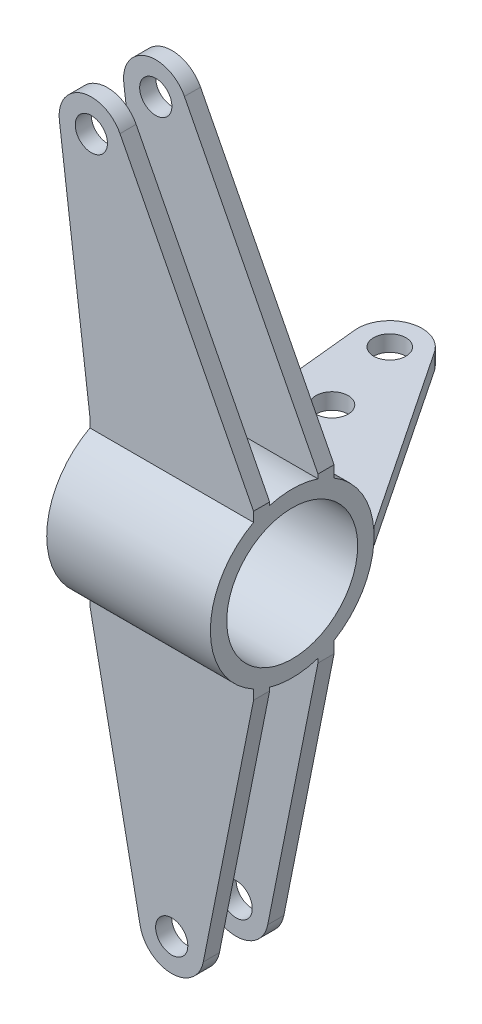
ISO-10303-21;
HEADER;
FILE_DESCRIPTION(('STEP AP214'),'2;1');
FILE_NAME('part.step','',(''),(''),'','','');
FILE_SCHEMA(('AUTOMOTIVE_DESIGN { 1 0 10303 214 1 1 1 1 }'));
ENDSEC;
DATA;
#1=APPLICATION_CONTEXT('core data for automotive mechanical design processes');
#2=APPLICATION_PROTOCOL_DEFINITION('international standard','automotive_design',2000,#1);
#3=PRODUCT_CONTEXT('',#1,'mechanical');
#4=PRODUCT('Part','Part','',(#3));
#5=PRODUCT_RELATED_PRODUCT_CATEGORY('part','',(#4));
#6=PRODUCT_DEFINITION_FORMATION('','',#4);
#7=PRODUCT_DEFINITION_CONTEXT('part definition',#1,'design');
#8=PRODUCT_DEFINITION('design','',#6,#7);
#9=PRODUCT_DEFINITION_SHAPE('','',#8);
#10=(LENGTH_UNIT() NAMED_UNIT(*) SI_UNIT(.MILLI.,.METRE.));
#11=(NAMED_UNIT(*) PLANE_ANGLE_UNIT() SI_UNIT($,.RADIAN.));
#12=(NAMED_UNIT(*) SI_UNIT($,.STERADIAN.) SOLID_ANGLE_UNIT());
#13=UNCERTAINTY_MEASURE_WITH_UNIT(LENGTH_MEASURE(1.E-05),#10,'distance_accuracy_value','');
#14=(GEOMETRIC_REPRESENTATION_CONTEXT(3) GLOBAL_UNCERTAINTY_ASSIGNED_CONTEXT((#13)) GLOBAL_UNIT_ASSIGNED_CONTEXT((#10,
#11,#12)) REPRESENTATION_CONTEXT('',''));
#15=CARTESIAN_POINT('',(0.,0.,0.));
#16=DIRECTION('',(0.,0.,1.));
#17=DIRECTION('',(1.,0.,0.));
#18=AXIS2_PLACEMENT_3D('',#15,#16,#17);
#19=CARTESIAN_POINT('',(-20.5175410322136,2.5,-76.2));
#20=DIRECTION('',(0.,1.,0.));
#21=DIRECTION('',(0.,0.,1.));
#22=AXIS2_PLACEMENT_3D('',#19,#20,#21);
#23=PLANE('',#22);
#24=CARTESIAN_POINT('',(-20.5175410322136,2.5,-76.2));
#25=DIRECTION('',(0.,1.,0.));
#26=DIRECTION('',(0.,0.,1.));
#27=AXIS2_PLACEMENT_3D('',#24,#25,#26);
#28=CIRCLE('',#27,5.);
#29=CARTESIAN_POINT('',(-20.5175410322136,2.5,-71.2));
#30=VERTEX_POINT('',#29);
#31=EDGE_CURVE('E116',#30,#30,#28,.T.);
#32=ORIENTED_EDGE('',*,*,#31,.F.);
#33=EDGE_LOOP('',(#32));
#34=FACE_BOUND('',#33,.T.);
#35=DIRECTION('',(1.,0.,0.));
#36=VECTOR('',#35,1.);
#37=CARTESIAN_POINT('',(-25.4,2.5,-25.4));
#38=LINE('',#37,#36);
#39=CARTESIAN_POINT('',(-25.4,2.5,-25.4));
#40=VERTEX_POINT('',#39);
#41=CARTESIAN_POINT('',(25.4,2.5,-25.4));
#42=VERTEX_POINT('',#41);
#43=EDGE_CURVE('E101',#40,#42,#38,.T.);
#44=ORIENTED_EDGE('',*,*,#43,.T.);
#45=DIRECTION('',(-0.555030974268581,0.,-0.831829680645305));
#46=VECTOR('',#45,1.);
#47=CARTESIAN_POINT('',(25.4,2.5,-25.4));
#48=LINE('',#47,#46);
#49=CARTESIAN_POINT('',(-12.1992442257605,2.5,-81.7503097426858));
#50=VERTEX_POINT('',#49);
#51=EDGE_CURVE('E96',#42,#50,#48,.T.);
#52=ORIENTED_EDGE('',*,*,#51,.T.);
#53=CARTESIAN_POINT('',(-20.5175410322136,2.5,-76.2));
#54=DIRECTION('',(0.,1.,0.));
#55=DIRECTION('',(0.,0.,1.));
#56=AXIS2_PLACEMENT_3D('',#53,#54,#55);
#57=CIRCLE('',#56,10.);
#58=CARTESIAN_POINT('',(-30.4661687352724,2.5,-75.1876725698025));
#59=VERTEX_POINT('',#58);
#60=EDGE_CURVE('E99',#50,#59,#57,.T.);
#61=ORIENTED_EDGE('',*,*,#60,.T.);
#62=DIRECTION('',(0.101232743019748,0.,0.994862770305884));
#63=VECTOR('',#62,1.);
#64=CARTESIAN_POINT('',(-25.4,2.5,-25.4));
#65=LINE('',#64,#63);
#66=EDGE_CURVE('E66',#59,#40,#65,.T.);
#67=ORIENTED_EDGE('',*,*,#66,.T.);
#68=EDGE_LOOP('',(#44,#52,#61,#67));
#69=FACE_BOUND('',#68,.T.);
#70=CARTESIAN_POINT('',(-13.9135676344222,2.5,-51.6735339814056));
#71=DIRECTION('',(0.,1.,0.));
#72=DIRECTION('',(0.,0.,1.));
#73=AXIS2_PLACEMENT_3D('',#70,#71,#72);
#74=CIRCLE('',#73,5.);
#75=CARTESIAN_POINT('',(-13.9135676344222,2.5,-46.6735339814056));
#76=VERTEX_POINT('',#75);
#77=EDGE_CURVE('E131',#76,#76,#74,.T.);
#78=ORIENTED_EDGE('',*,*,#77,.F.);
#79=EDGE_LOOP('',(#78));
#80=FACE_BOUND('',#79,.T.);
#81=ADVANCED_FACE('F49',(#34,#69,#80),#23,.T.);
#82=CARTESIAN_POINT('',(-20.5175410322136,-2.5,-76.2));
#83=DIRECTION('',(0.,1.,0.));
#84=DIRECTION('',(0.,0.,1.));
#85=AXIS2_PLACEMENT_3D('',#82,#83,#84);
#86=PLANE('',#85);
#87=DIRECTION('',(1.,0.,0.));
#88=VECTOR('',#87,1.);
#89=CARTESIAN_POINT('',(-25.4,-2.5,-25.4));
#90=LINE('',#89,#88);
#91=CARTESIAN_POINT('',(-25.4,-2.5,-25.4));
#92=VERTEX_POINT('',#91);
#93=CARTESIAN_POINT('',(25.4,-2.5,-25.4));
#94=VERTEX_POINT('',#93);
#95=EDGE_CURVE('E113',#92,#94,#90,.T.);
#96=ORIENTED_EDGE('',*,*,#95,.F.);
#97=DIRECTION('',(0.101232743019748,0.,0.994862770305884));
#98=VECTOR('',#97,1.);
#99=CARTESIAN_POINT('',(-25.4,-2.5,-25.4));
#100=LINE('',#99,#98);
#101=CARTESIAN_POINT('',(-30.4661687352724,-2.5,-75.1876725698025));
#102=VERTEX_POINT('',#101);
#103=EDGE_CURVE('E89',#102,#92,#100,.T.);
#104=ORIENTED_EDGE('',*,*,#103,.F.);
#105=CARTESIAN_POINT('',(-20.5175410322136,-2.5,-76.2));
#106=DIRECTION('',(0.,1.,0.));
#107=DIRECTION('',(0.,0.,1.));
#108=AXIS2_PLACEMENT_3D('',#105,#106,#107);
#109=CIRCLE('',#108,10.);
#110=CARTESIAN_POINT('',(-12.1992442257605,-2.5,-81.7503097426858));
#111=VERTEX_POINT('',#110);
#112=EDGE_CURVE('E83',#111,#102,#109,.T.);
#113=ORIENTED_EDGE('',*,*,#112,.F.);
#114=DIRECTION('',(-0.555030974268581,0.,-0.831829680645305));
#115=VECTOR('',#114,1.);
#116=CARTESIAN_POINT('',(25.4,-2.5,-25.4));
#117=LINE('',#116,#115);
#118=EDGE_CURVE('E105',#94,#111,#117,.T.);
#119=ORIENTED_EDGE('',*,*,#118,.F.);
#120=EDGE_LOOP('',(#96,#104,#113,#119));
#121=FACE_BOUND('',#120,.T.);
#122=CARTESIAN_POINT('',(-20.5175410322136,-2.5,-76.2));
#123=DIRECTION('',(0.,1.,0.));
#124=DIRECTION('',(0.,0.,1.));
#125=AXIS2_PLACEMENT_3D('',#122,#123,#124);
#126=CIRCLE('',#125,5.);
#127=CARTESIAN_POINT('',(-20.5175410322136,-2.5,-71.2));
#128=VERTEX_POINT('',#127);
#129=EDGE_CURVE('E128',#128,#128,#126,.T.);
#130=ORIENTED_EDGE('',*,*,#129,.T.);
#131=EDGE_LOOP('',(#130));
#132=FACE_BOUND('',#131,.T.);
#133=CARTESIAN_POINT('',(-13.9135676344222,-2.5,-51.6735339814056));
#134=DIRECTION('',(0.,1.,0.));
#135=DIRECTION('',(0.,0.,1.));
#136=AXIS2_PLACEMENT_3D('',#133,#134,#135);
#137=CIRCLE('',#136,5.);
#138=CARTESIAN_POINT('',(-13.9135676344222,-2.5,-46.6735339814056));
#139=VERTEX_POINT('',#138);
#140=EDGE_CURVE('E134',#139,#139,#137,.T.);
#141=ORIENTED_EDGE('',*,*,#140,.T.);
#142=EDGE_LOOP('',(#141));
#143=FACE_BOUND('',#142,.T.);
#144=ADVANCED_FACE('F124',(#121,#132,#143),#86,.F.);
#145=CARTESIAN_POINT('',(-25.4,2.5,-25.4));
#146=DIRECTION('',(0.,0.,-1.));
#147=DIRECTION('',(-1.,0.,0.));
#148=AXIS2_PLACEMENT_3D('',#145,#146,#147);
#149=PLANE('',#148);
#150=ORIENTED_EDGE('',*,*,#95,.T.);
#151=DIRECTION('',(0.,-1.,0.));
#152=VECTOR('',#151,1.);
#153=CARTESIAN_POINT('',(25.4,2.5,-25.4));
#154=LINE('',#153,#152);
#155=EDGE_CURVE('E12',#42,#94,#154,.T.);
#156=ORIENTED_EDGE('',*,*,#155,.F.);
#157=ORIENTED_EDGE('',*,*,#43,.F.);
#158=DIRECTION('',(0.,-1.,0.));
#159=VECTOR('',#158,1.);
#160=CARTESIAN_POINT('',(-25.4,2.5,-25.4));
#161=LINE('',#160,#159);
#162=EDGE_CURVE('E109',#40,#92,#161,.T.);
#163=ORIENTED_EDGE('',*,*,#162,.T.);
#164=EDGE_LOOP('',(#150,#156,#157,#163));
#165=FACE_BOUND('',#164,.T.);
#166=ADVANCED_FACE('F51',(#165),#149,.F.);
#167=CARTESIAN_POINT('',(25.4,2.5,-25.4));
#168=DIRECTION('',(-0.831829680645305,0.,0.555030974268581));
#169=DIRECTION('',(0.555030974268581,0.,0.831829680645305));
#170=AXIS2_PLACEMENT_3D('',#167,#168,#169);
#171=PLANE('',#170);
#172=ORIENTED_EDGE('',*,*,#118,.T.);
#173=DIRECTION('',(0.,-1.,0.));
#174=VECTOR('',#173,1.);
#175=CARTESIAN_POINT('',(-12.1992442257605,2.5,-81.7503097426858));
#176=LINE('',#175,#174);
#177=EDGE_CURVE('E58',#50,#111,#176,.T.);
#178=ORIENTED_EDGE('',*,*,#177,.F.);
#179=ORIENTED_EDGE('',*,*,#51,.F.);
#180=ORIENTED_EDGE('',*,*,#155,.T.);
#181=EDGE_LOOP('',(#172,#178,#179,#180));
#182=FACE_BOUND('',#181,.T.);
#183=ADVANCED_FACE('F104',(#182),#171,.F.);
#184=CARTESIAN_POINT('',(-20.5175410322136,2.5,-76.2));
#185=DIRECTION('',(0.,-1.,0.));
#186=DIRECTION('',(0.,0.,-1.));
#187=AXIS2_PLACEMENT_3D('',#184,#185,#186);
#188=CYLINDRICAL_SURFACE('',#187,10.);
#189=ORIENTED_EDGE('',*,*,#112,.T.);
#190=DIRECTION('',(0.,-1.,0.));
#191=VECTOR('',#190,1.);
#192=CARTESIAN_POINT('',(-30.4661687352724,2.5,-75.1876725698025));
#193=LINE('',#192,#191);
#194=EDGE_CURVE('E106',#59,#102,#193,.T.);
#195=ORIENTED_EDGE('',*,*,#194,.F.);
#196=ORIENTED_EDGE('',*,*,#60,.F.);
#197=ORIENTED_EDGE('',*,*,#177,.T.);
#198=EDGE_LOOP('',(#189,#195,#196,#197));
#199=FACE_BOUND('',#198,.T.);
#200=ADVANCED_FACE('F107',(#199),#188,.T.);
#201=CARTESIAN_POINT('',(-25.4,2.5,-25.4));
#202=DIRECTION('',(0.994862770305884,0.,-0.101232743019748));
#203=DIRECTION('',(-0.101232743019748,0.,-0.994862770305884));
#204=AXIS2_PLACEMENT_3D('',#201,#202,#203);
#205=PLANE('',#204);
#206=ORIENTED_EDGE('',*,*,#103,.T.);
#207=ORIENTED_EDGE('',*,*,#162,.F.);
#208=ORIENTED_EDGE('',*,*,#66,.F.);
#209=ORIENTED_EDGE('',*,*,#194,.T.);
#210=EDGE_LOOP('',(#206,#207,#208,#209));
#211=FACE_BOUND('',#210,.T.);
#212=ADVANCED_FACE('F121',(#211),#205,.F.);
#213=CARTESIAN_POINT('',(-20.5175410322136,2.5,-76.2));
#214=DIRECTION('',(0.,-1.,0.));
#215=DIRECTION('',(0.,0.,-1.));
#216=AXIS2_PLACEMENT_3D('',#213,#214,#215);
#217=CYLINDRICAL_SURFACE('',#216,5.);
#218=ORIENTED_EDGE('',*,*,#31,.T.);
#219=EDGE_LOOP('',(#218));
#220=FACE_BOUND('',#219,.T.);
#221=ORIENTED_EDGE('',*,*,#129,.F.);
#222=EDGE_LOOP('',(#221));
#223=FACE_BOUND('',#222,.T.);
#224=ADVANCED_FACE('F151',(#220,#223),#217,.F.);
#225=CARTESIAN_POINT('',(-13.9135676344222,2.5,-51.6735339814056));
#226=DIRECTION('',(0.,-1.,0.));
#227=DIRECTION('',(0.,0.,-1.));
#228=AXIS2_PLACEMENT_3D('',#225,#226,#227);
#229=CYLINDRICAL_SURFACE('',#228,5.);
#230=ORIENTED_EDGE('',*,*,#77,.T.);
#231=EDGE_LOOP('',(#230));
#232=FACE_BOUND('',#231,.T.);
#233=ORIENTED_EDGE('',*,*,#140,.F.);
#234=EDGE_LOOP('',(#233));
#235=FACE_BOUND('',#234,.T.);
#236=ADVANCED_FACE('F140',(#232,#235),#229,.F.);
#237=CLOSED_SHELL('',(#81,#144,#166,#183,#200,#212,#224,#236));
#238=MANIFOLD_SOLID_BREP('B2',#237);
#239=CARTESIAN_POINT('',(25.4,0.,0.));
#240=DIRECTION('',(-1.,0.,0.));
#241=DIRECTION('',(0.,0.,1.));
#242=AXIS2_PLACEMENT_3D('',#239,#240,#241);
#243=CYLINDRICAL_SURFACE('',#242,25.4);
#244=DIRECTION('',(-1.,0.,0.));
#245=VECTOR('',#244,1.);
#246=CARTESIAN_POINT('',(25.4,24.1072603171742,-8.));
#247=LINE('',#246,#245);
#248=CARTESIAN_POINT('',(25.4,24.1072603171742,-8.));
#249=VERTEX_POINT('',#248);
#250=CARTESIAN_POINT('',(-25.4,24.1072603171742,-8.));
#251=VERTEX_POINT('',#250);
#252=EDGE_CURVE('E446',#249,#251,#247,.T.);
#253=ORIENTED_EDGE('',*,*,#252,.T.);
#254=CARTESIAN_POINT('',(-25.4,0.,0.));
#255=DIRECTION('',(1.,0.,0.));
#256=DIRECTION('',(0.,0.,-1.));
#257=AXIS2_PLACEMENT_3D('',#254,#255,#256);
#258=CIRCLE('',#257,25.4);
#259=CARTESIAN_POINT('',(-25.4,24.416387939251,7.));
#260=VERTEX_POINT('',#259);
#261=EDGE_CURVE('E697',#251,#260,#258,.T.);
#262=ORIENTED_EDGE('',*,*,#261,.T.);
#263=DIRECTION('',(-1.,0.,0.));
#264=VECTOR('',#263,1.);
#265=CARTESIAN_POINT('',(25.4,24.416387939251,7.));
#266=LINE('',#265,#264);
#267=CARTESIAN_POINT('',(25.4,24.416387939251,7.));
#268=VERTEX_POINT('',#267);
#269=EDGE_CURVE('E497',#268,#260,#266,.T.);
#270=ORIENTED_EDGE('',*,*,#269,.F.);
#271=CARTESIAN_POINT('',(25.4,0.,0.));
#272=DIRECTION('',(1.,0.,0.));
#273=DIRECTION('',(0.,0.,-1.));
#274=AXIS2_PLACEMENT_3D('',#271,#272,#273);
#275=CIRCLE('',#274,25.4);
#276=EDGE_CURVE('E225',#249,#268,#275,.T.);
#277=ORIENTED_EDGE('',*,*,#276,.F.);
#278=EDGE_LOOP('',(#253,#262,#270,#277));
#279=FACE_BOUND('',#278,.T.);
#280=ADVANCED_FACE('F215',(#279),#243,.T.);
#281=DIRECTION('',(-1.,0.,0.));
#282=VECTOR('',#281,1.);
#283=CARTESIAN_POINT('',(25.4,21.8210907151774,-13.));
#284=LINE('',#283,#282);
#285=CARTESIAN_POINT('',(25.4,21.8210907151774,-13.));
#286=VERTEX_POINT('',#285);
#287=CARTESIAN_POINT('',(-25.4,21.8210907151774,-13.));
#288=VERTEX_POINT('',#287);
#289=EDGE_CURVE('E434',#286,#288,#284,.T.);
#290=ORIENTED_EDGE('',*,*,#289,.F.);
#291=CARTESIAN_POINT('',(25.4,-21.8210907151774,-13.));
#292=VERTEX_POINT('',#291);
#293=EDGE_CURVE('E47',#292,#286,#275,.T.);
#294=ORIENTED_EDGE('',*,*,#293,.F.);
#295=DIRECTION('',(-1.,0.,0.));
#296=VECTOR('',#295,1.);
#297=CARTESIAN_POINT('',(25.4,-21.8210907151774,-13.));
#298=LINE('',#297,#296);
#299=CARTESIAN_POINT('',(-25.4,-21.8210907151774,-13.));
#300=VERTEX_POINT('',#299);
#301=EDGE_CURVE('E639',#292,#300,#298,.T.);
#302=ORIENTED_EDGE('',*,*,#301,.T.);
#303=EDGE_CURVE('E219',#300,#288,#258,.T.);
#304=ORIENTED_EDGE('',*,*,#303,.T.);
#305=EDGE_LOOP('',(#290,#294,#302,#304));
#306=FACE_BOUND('',#305,.T.);
#307=ADVANCED_FACE('F671',(#306),#243,.T.);
#308=DIRECTION('',(-1.,0.,0.));
#309=VECTOR('',#308,1.);
#310=CARTESIAN_POINT('',(25.4,22.3866031366976,12.));
#311=LINE('',#310,#309);
#312=CARTESIAN_POINT('',(25.4,22.3866031366976,12.));
#313=VERTEX_POINT('',#312);
#314=CARTESIAN_POINT('',(-25.4,22.3866031366976,12.));
#315=VERTEX_POINT('',#314);
#316=EDGE_CURVE('E510',#313,#315,#311,.T.);
#317=ORIENTED_EDGE('',*,*,#316,.T.);
#318=CARTESIAN_POINT('',(-25.4,-22.3866031366976,12.));
#319=VERTEX_POINT('',#318);
#320=EDGE_CURVE('E685',#315,#319,#258,.T.);
#321=ORIENTED_EDGE('',*,*,#320,.T.);
#322=DIRECTION('',(-1.,0.,0.));
#323=VECTOR('',#322,1.);
#324=CARTESIAN_POINT('',(25.4,-22.3866031366976,12.));
#325=LINE('',#324,#323);
#326=CARTESIAN_POINT('',(25.4,-22.3866031366976,12.));
#327=VERTEX_POINT('',#326);
#328=EDGE_CURVE('E562',#327,#319,#325,.T.);
#329=ORIENTED_EDGE('',*,*,#328,.F.);
#330=EDGE_CURVE('E686',#313,#327,#275,.T.);
#331=ORIENTED_EDGE('',*,*,#330,.F.);
#332=EDGE_LOOP('',(#317,#321,#329,#331));
#333=FACE_BOUND('',#332,.T.);
#334=ADVANCED_FACE('F217',(#333),#243,.T.);
#335=DIRECTION('',(-1.,0.,0.));
#336=VECTOR('',#335,1.);
#337=CARTESIAN_POINT('',(25.4,-24.416387939251,7.));
#338=LINE('',#337,#336);
#339=CARTESIAN_POINT('',(25.4,-24.416387939251,7.));
#340=VERTEX_POINT('',#339);
#341=CARTESIAN_POINT('',(-25.4,-24.416387939251,7.));
#342=VERTEX_POINT('',#341);
#343=EDGE_CURVE('E575',#340,#342,#338,.T.);
#344=ORIENTED_EDGE('',*,*,#343,.T.);
#345=CARTESIAN_POINT('',(-25.4,-24.1072603171742,-8.));
#346=VERTEX_POINT('',#345);
#347=EDGE_CURVE('E648',#342,#346,#258,.T.);
#348=ORIENTED_EDGE('',*,*,#347,.T.);
#349=DIRECTION('',(-1.,0.,0.));
#350=VECTOR('',#349,1.);
#351=CARTESIAN_POINT('',(25.4,-24.1072603171742,-8.));
#352=LINE('',#351,#350);
#353=CARTESIAN_POINT('',(25.4,-24.1072603171742,-8.));
#354=VERTEX_POINT('',#353);
#355=EDGE_CURVE('E626',#354,#346,#352,.T.);
#356=ORIENTED_EDGE('',*,*,#355,.F.);
#357=EDGE_CURVE('E226',#340,#354,#275,.T.);
#358=ORIENTED_EDGE('',*,*,#357,.F.);
#359=EDGE_LOOP('',(#344,#348,#356,#358));
#360=FACE_BOUND('',#359,.T.);
#361=ADVANCED_FACE('F676',(#360),#243,.T.);
#362=CARTESIAN_POINT('',(25.4,0.,0.));
#363=DIRECTION('',(1.,0.,0.));
#364=DIRECTION('',(0.,0.,-1.));
#365=AXIS2_PLACEMENT_3D('',#362,#363,#364);
#366=PLANE('',#365);
#367=ORIENTED_EDGE('',*,*,#293,.T.);
#368=DIRECTION('',(0.,1.,0.));
#369=VECTOR('',#368,1.);
#370=CARTESIAN_POINT('',(25.4,25.4,-13.));
#371=LINE('',#370,#369);
#372=CARTESIAN_POINT('',(25.4,25.4,-13.));
#373=VERTEX_POINT('',#372);
#374=EDGE_CURVE('E427',#286,#373,#371,.T.);
#375=ORIENTED_EDGE('',*,*,#374,.T.);
#376=DIRECTION('',(0.,0.,1.));
#377=VECTOR('',#376,1.);
#378=CARTESIAN_POINT('',(25.4,25.4,-8.));
#379=LINE('',#378,#377);
#380=CARTESIAN_POINT('',(25.4,25.4,-8.));
#381=VERTEX_POINT('',#380);
#382=EDGE_CURVE('E431',#373,#381,#379,.T.);
#383=ORIENTED_EDGE('',*,*,#382,.T.);
#384=DIRECTION('',(0.,-1.,0.));
#385=VECTOR('',#384,1.);
#386=CARTESIAN_POINT('',(25.4,25.4,-8.));
#387=LINE('',#386,#385);
#388=EDGE_CURVE('E387',#381,#249,#387,.T.);
#389=ORIENTED_EDGE('',*,*,#388,.T.);
#390=ORIENTED_EDGE('',*,*,#276,.T.);
#391=DIRECTION('',(0.,1.,0.));
#392=VECTOR('',#391,1.);
#393=CARTESIAN_POINT('',(25.4,25.4,7.));
#394=LINE('',#393,#392);
#395=CARTESIAN_POINT('',(25.4,25.4,7.));
#396=VERTEX_POINT('',#395);
#397=EDGE_CURVE('E490',#268,#396,#394,.T.);
#398=ORIENTED_EDGE('',*,*,#397,.T.);
#399=DIRECTION('',(0.,0.,1.));
#400=VECTOR('',#399,1.);
#401=CARTESIAN_POINT('',(25.4,25.4,12.));
#402=LINE('',#401,#400);
#403=CARTESIAN_POINT('',(25.4,25.4,12.));
#404=VERTEX_POINT('',#403);
#405=EDGE_CURVE('E494',#396,#404,#402,.T.);
#406=ORIENTED_EDGE('',*,*,#405,.T.);
#407=DIRECTION('',(0.,-1.,0.));
#408=VECTOR('',#407,1.);
#409=CARTESIAN_POINT('',(25.4,25.4,12.));
#410=LINE('',#409,#408);
#411=EDGE_CURVE('E486',#404,#313,#410,.T.);
#412=ORIENTED_EDGE('',*,*,#411,.T.);
#413=ORIENTED_EDGE('',*,*,#330,.T.);
#414=DIRECTION('',(0.,-1.,0.));
#415=VECTOR('',#414,1.);
#416=CARTESIAN_POINT('',(25.4,-25.4,12.));
#417=LINE('',#416,#415);
#418=CARTESIAN_POINT('',(25.4,-25.4,12.));
#419=VERTEX_POINT('',#418);
#420=EDGE_CURVE('E549',#327,#419,#417,.T.);
#421=ORIENTED_EDGE('',*,*,#420,.T.);
#422=DIRECTION('',(0.,0.,-1.));
#423=VECTOR('',#422,1.);
#424=CARTESIAN_POINT('',(25.4,-25.4,12.));
#425=LINE('',#424,#423);
#426=CARTESIAN_POINT('',(25.4,-25.4,7.));
#427=VERTEX_POINT('',#426);
#428=EDGE_CURVE('E553',#419,#427,#425,.T.);
#429=ORIENTED_EDGE('',*,*,#428,.T.);
#430=DIRECTION('',(0.,1.,0.));
#431=VECTOR('',#430,1.);
#432=CARTESIAN_POINT('',(25.4,-25.4,7.));
#433=LINE('',#432,#431);
#434=EDGE_CURVE('E558',#427,#340,#433,.T.);
#435=ORIENTED_EDGE('',*,*,#434,.T.);
#436=ORIENTED_EDGE('',*,*,#357,.T.);
#437=DIRECTION('',(0.,-1.,0.));
#438=VECTOR('',#437,1.);
#439=CARTESIAN_POINT('',(25.4,-25.4,-8.));
#440=LINE('',#439,#438);
#441=CARTESIAN_POINT('',(25.4,-25.4,-8.));
#442=VERTEX_POINT('',#441);
#443=EDGE_CURVE('E614',#354,#442,#440,.T.);
#444=ORIENTED_EDGE('',*,*,#443,.T.);
#445=DIRECTION('',(0.,0.,-1.));
#446=VECTOR('',#445,1.);
#447=CARTESIAN_POINT('',(25.4,-25.4,-8.));
#448=LINE('',#447,#446);
#449=CARTESIAN_POINT('',(25.4,-25.4,-13.));
#450=VERTEX_POINT('',#449);
#451=EDGE_CURVE('E618',#442,#450,#448,.T.);
#452=ORIENTED_EDGE('',*,*,#451,.T.);
#453=DIRECTION('',(0.,1.,0.));
#454=VECTOR('',#453,1.);
#455=CARTESIAN_POINT('',(25.4,-25.4,-13.));
#456=LINE('',#455,#454);
#457=EDGE_CURVE('E623',#450,#292,#456,.T.);
#458=ORIENTED_EDGE('',*,*,#457,.T.);
#459=EDGE_LOOP('',(#367,#375,#383,#389,#390,#398,#406,#412,#413,#421,#429,#435,#436,#444,#452,#458));
#460=FACE_BOUND('',#459,.T.);
#461=CARTESIAN_POINT('',(25.4,0.,0.));
#462=DIRECTION('',(1.,0.,0.));
#463=DIRECTION('',(0.,0.,-1.));
#464=AXIS2_PLACEMENT_3D('',#461,#462,#463);
#465=CIRCLE('',#464,20.32);
#466=CARTESIAN_POINT('',(25.4,0.,-20.32));
#467=VERTEX_POINT('',#466);
#468=EDGE_CURVE('E644',#467,#467,#465,.T.);
#469=ORIENTED_EDGE('',*,*,#468,.F.);
#470=EDGE_LOOP('',(#469));
#471=FACE_BOUND('',#470,.T.);
#472=ADVANCED_FACE('F667',(#460,#471),#366,.T.);
#473=CARTESIAN_POINT('',(-25.4,0.,0.));
#474=DIRECTION('',(1.,0.,0.));
#475=DIRECTION('',(0.,0.,-1.));
#476=AXIS2_PLACEMENT_3D('',#473,#474,#475);
#477=PLANE('',#476);
#478=ORIENTED_EDGE('',*,*,#303,.F.);
#479=DIRECTION('',(0.,1.,0.));
#480=VECTOR('',#479,1.);
#481=CARTESIAN_POINT('',(-25.4,-25.4,-13.));
#482=LINE('',#481,#480);
#483=CARTESIAN_POINT('',(-25.4,-25.4,-13.));
#484=VERTEX_POINT('',#483);
#485=EDGE_CURVE('E619',#484,#300,#482,.T.);
#486=ORIENTED_EDGE('',*,*,#485,.F.);
#487=DIRECTION('',(0.,0.,-1.));
#488=VECTOR('',#487,1.);
#489=CARTESIAN_POINT('',(-25.4,-25.4,-8.));
#490=LINE('',#489,#488);
#491=CARTESIAN_POINT('',(-25.4,-25.4,-8.));
#492=VERTEX_POINT('',#491);
#493=EDGE_CURVE('E630',#492,#484,#490,.T.);
#494=ORIENTED_EDGE('',*,*,#493,.F.);
#495=DIRECTION('',(0.,-1.,0.));
#496=VECTOR('',#495,1.);
#497=CARTESIAN_POINT('',(-25.4,-25.4,-8.));
#498=LINE('',#497,#496);
#499=EDGE_CURVE('E613',#346,#492,#498,.T.);
#500=ORIENTED_EDGE('',*,*,#499,.F.);
#501=ORIENTED_EDGE('',*,*,#347,.F.);
#502=DIRECTION('',(0.,1.,0.));
#503=VECTOR('',#502,1.);
#504=CARTESIAN_POINT('',(-25.4,-25.4,7.));
#505=LINE('',#504,#503);
#506=CARTESIAN_POINT('',(-25.4,-25.4,7.));
#507=VERTEX_POINT('',#506);
#508=EDGE_CURVE('E554',#507,#342,#505,.T.);
#509=ORIENTED_EDGE('',*,*,#508,.F.);
#510=DIRECTION('',(0.,0.,-1.));
#511=VECTOR('',#510,1.);
#512=CARTESIAN_POINT('',(-25.4,-25.4,12.));
#513=LINE('',#512,#511);
#514=CARTESIAN_POINT('',(-25.4,-25.4,12.));
#515=VERTEX_POINT('',#514);
#516=EDGE_CURVE('E566',#515,#507,#513,.T.);
#517=ORIENTED_EDGE('',*,*,#516,.F.);
#518=DIRECTION('',(0.,-1.,0.));
#519=VECTOR('',#518,1.);
#520=CARTESIAN_POINT('',(-25.4,-25.4,12.));
#521=LINE('',#520,#519);
#522=EDGE_CURVE('E548',#319,#515,#521,.T.);
#523=ORIENTED_EDGE('',*,*,#522,.F.);
#524=ORIENTED_EDGE('',*,*,#320,.F.);
#525=DIRECTION('',(0.,-1.,0.));
#526=VECTOR('',#525,1.);
#527=CARTESIAN_POINT('',(-25.4,25.4,12.));
#528=LINE('',#527,#526);
#529=CARTESIAN_POINT('',(-25.4,25.4,12.));
#530=VERTEX_POINT('',#529);
#531=EDGE_CURVE('E485',#530,#315,#528,.T.);
#532=ORIENTED_EDGE('',*,*,#531,.F.);
#533=DIRECTION('',(0.,0.,1.));
#534=VECTOR('',#533,1.);
#535=CARTESIAN_POINT('',(-25.4,25.4,12.));
#536=LINE('',#535,#534);
#537=CARTESIAN_POINT('',(-25.4,25.4,7.));
#538=VERTEX_POINT('',#537);
#539=EDGE_CURVE('E491',#538,#530,#536,.T.);
#540=ORIENTED_EDGE('',*,*,#539,.F.);
#541=DIRECTION('',(0.,1.,0.));
#542=VECTOR('',#541,1.);
#543=CARTESIAN_POINT('',(-25.4,25.4,7.));
#544=LINE('',#543,#542);
#545=EDGE_CURVE('E501',#260,#538,#544,.T.);
#546=ORIENTED_EDGE('',*,*,#545,.F.);
#547=ORIENTED_EDGE('',*,*,#261,.F.);
#548=DIRECTION('',(0.,-1.,0.));
#549=VECTOR('',#548,1.);
#550=CARTESIAN_POINT('',(-25.4,25.4,-8.));
#551=LINE('',#550,#549);
#552=CARTESIAN_POINT('',(-25.4,25.4,-8.));
#553=VERTEX_POINT('',#552);
#554=EDGE_CURVE('E401',#553,#251,#551,.T.);
#555=ORIENTED_EDGE('',*,*,#554,.F.);
#556=DIRECTION('',(0.,0.,1.));
#557=VECTOR('',#556,1.);
#558=CARTESIAN_POINT('',(-25.4,25.4,-8.));
#559=LINE('',#558,#557);
#560=CARTESIAN_POINT('',(-25.4,25.4,-13.));
#561=VERTEX_POINT('',#560);
#562=EDGE_CURVE('E428',#561,#553,#559,.T.);
#563=ORIENTED_EDGE('',*,*,#562,.F.);
#564=DIRECTION('',(0.,1.,0.));
#565=VECTOR('',#564,1.);
#566=CARTESIAN_POINT('',(-25.4,25.4,-13.));
#567=LINE('',#566,#565);
#568=EDGE_CURVE('E437',#288,#561,#567,.T.);
#569=ORIENTED_EDGE('',*,*,#568,.F.);
#570=EDGE_LOOP('',(#478,#486,#494,#500,#501,#509,#517,#523,#524,#532,#540,#546,#547,#555,#563,#569));
#571=FACE_BOUND('',#570,.T.);
#572=CARTESIAN_POINT('',(-25.4,0.,0.));
#573=DIRECTION('',(1.,0.,0.));
#574=DIRECTION('',(0.,0.,-1.));
#575=AXIS2_PLACEMENT_3D('',#572,#573,#574);
#576=CIRCLE('',#575,20.32);
#577=CARTESIAN_POINT('',(-25.4,0.,-20.32));
#578=VERTEX_POINT('',#577);
#579=EDGE_CURVE('E643',#578,#578,#576,.T.);
#580=ORIENTED_EDGE('',*,*,#579,.T.);
#581=EDGE_LOOP('',(#580));
#582=FACE_BOUND('',#581,.T.);
#583=ADVANCED_FACE('F653',(#571,#582),#477,.F.);
#584=CARTESIAN_POINT('',(25.4,0.,0.));
#585=DIRECTION('',(-1.,0.,0.));
#586=DIRECTION('',(0.,0.,1.));
#587=AXIS2_PLACEMENT_3D('',#584,#585,#586);
#588=CYLINDRICAL_SURFACE('',#587,20.32);
#589=ORIENTED_EDGE('',*,*,#468,.T.);
#590=EDGE_LOOP('',(#589));
#591=FACE_BOUND('',#590,.T.);
#592=ORIENTED_EDGE('',*,*,#579,.F.);
#593=EDGE_LOOP('',(#592));
#594=FACE_BOUND('',#593,.T.);
#595=ADVANCED_FACE('F655',(#591,#594),#588,.F.);
#596=CARTESIAN_POINT('',(25.4,-25.4,-8.));
#597=DIRECTION('',(0.,0.,-1.));
#598=DIRECTION('',(-1.,0.,0.));
#599=AXIS2_PLACEMENT_3D('',#596,#597,#598);
#600=PLANE('',#599);
#601=ORIENTED_EDGE('',*,*,#499,.T.);
#602=DIRECTION('',(0.195657188634298,-0.980672353304468,0.));
#603=VECTOR('',#602,1.);
#604=CARTESIAN_POINT('',(-25.4,-25.4,-8.));
#605=LINE('',#604,#603);
#606=CARTESIAN_POINT('',(-9.80672353304465,-103.556571886343,-8.));
#607=VERTEX_POINT('',#606);
#608=EDGE_CURVE('E588',#492,#607,#605,.T.);
#609=ORIENTED_EDGE('',*,*,#608,.T.);
#610=CARTESIAN_POINT('',(0.,-101.6,-8.));
#611=DIRECTION('',(0.,0.,1.));
#612=DIRECTION('',(1.,0.,0.));
#613=AXIS2_PLACEMENT_3D('',#610,#611,#612);
#614=CIRCLE('',#613,10.);
#615=CARTESIAN_POINT('',(9.8067235330447,-103.556571886343,-8.));
#616=VERTEX_POINT('',#615);
#617=EDGE_CURVE('E591',#607,#616,#614,.T.);
#618=ORIENTED_EDGE('',*,*,#617,.T.);
#619=DIRECTION('',(0.195657188634297,0.980672353304468,0.));
#620=VECTOR('',#619,1.);
#621=CARTESIAN_POINT('',(25.4,-25.4,-8.));
#622=LINE('',#621,#620);
#623=EDGE_CURVE('E595',#616,#442,#622,.T.);
#624=ORIENTED_EDGE('',*,*,#623,.T.);
#625=ORIENTED_EDGE('',*,*,#443,.F.);
#626=ORIENTED_EDGE('',*,*,#355,.T.);
#627=EDGE_LOOP('',(#601,#609,#618,#624,#625,#626));
#628=FACE_BOUND('',#627,.T.);
#629=CARTESIAN_POINT('',(0.,-101.6,-8.));
#630=DIRECTION('',(0.,0.,1.));
#631=DIRECTION('',(1.,0.,0.));
#632=AXIS2_PLACEMENT_3D('',#629,#630,#631);
#633=CIRCLE('',#632,5.00000000000001);
#634=CARTESIAN_POINT('',(5.00000000000003,-101.6,-8.));
#635=VERTEX_POINT('',#634);
#636=EDGE_CURVE('E580',#635,#635,#633,.T.);
#637=ORIENTED_EDGE('',*,*,#636,.F.);
#638=EDGE_LOOP('',(#637));
#639=FACE_BOUND('',#638,.T.);
#640=ADVANCED_FACE('F657',(#628,#639),#600,.F.);
#641=CARTESIAN_POINT('',(25.4,-25.4,-13.));
#642=DIRECTION('',(0.,0.,1.));
#643=DIRECTION('',(1.,0.,0.));
#644=AXIS2_PLACEMENT_3D('',#641,#642,#643);
#645=PLANE('',#644);
#646=ORIENTED_EDGE('',*,*,#485,.T.);
#647=ORIENTED_EDGE('',*,*,#301,.F.);
#648=ORIENTED_EDGE('',*,*,#457,.F.);
#649=DIRECTION('',(0.195657188634297,0.980672353304468,0.));
#650=VECTOR('',#649,1.);
#651=CARTESIAN_POINT('',(25.4,-25.4,-13.));
#652=LINE('',#651,#650);
#653=CARTESIAN_POINT('',(9.8067235330447,-103.556571886343,-13.));
#654=VERTEX_POINT('',#653);
#655=EDGE_CURVE('E592',#654,#450,#652,.T.);
#656=ORIENTED_EDGE('',*,*,#655,.F.);
#657=CARTESIAN_POINT('',(0.,-101.6,-13.));
#658=DIRECTION('',(0.,0.,1.));
#659=DIRECTION('',(1.,0.,0.));
#660=AXIS2_PLACEMENT_3D('',#657,#658,#659);
#661=CIRCLE('',#660,10.);
#662=CARTESIAN_POINT('',(-9.80672353304465,-103.556571886343,-13.));
#663=VERTEX_POINT('',#662);
#664=EDGE_CURVE('E601',#663,#654,#661,.T.);
#665=ORIENTED_EDGE('',*,*,#664,.F.);
#666=DIRECTION('',(0.195657188634298,-0.980672353304468,0.));
#667=VECTOR('',#666,1.);
#668=CARTESIAN_POINT('',(-25.4,-25.4,-13.));
#669=LINE('',#668,#667);
#670=EDGE_CURVE('E584',#484,#663,#669,.T.);
#671=ORIENTED_EDGE('',*,*,#670,.F.);
#672=EDGE_LOOP('',(#646,#647,#648,#656,#665,#671));
#673=FACE_BOUND('',#672,.T.);
#674=CARTESIAN_POINT('',(0.,-101.6,-13.));
#675=DIRECTION('',(0.,0.,1.));
#676=DIRECTION('',(1.,0.,0.));
#677=AXIS2_PLACEMENT_3D('',#674,#675,#676);
#678=CIRCLE('',#677,5.00000000000001);
#679=CARTESIAN_POINT('',(5.00000000000003,-101.6,-13.));
#680=VERTEX_POINT('',#679);
#681=EDGE_CURVE('E579',#680,#680,#678,.T.);
#682=ORIENTED_EDGE('',*,*,#681,.T.);
#683=EDGE_LOOP('',(#682));
#684=FACE_BOUND('',#683,.T.);
#685=ADVANCED_FACE('F664',(#673,#684),#645,.F.);
#686=CARTESIAN_POINT('',(-25.4,-25.4,-8.));
#687=DIRECTION('',(0.980672353304468,0.195657188634298,0.));
#688=DIRECTION('',(-0.195657188634298,0.980672353304468,0.));
#689=AXIS2_PLACEMENT_3D('',#686,#687,#688);
#690=PLANE('',#689);
#691=ORIENTED_EDGE('',*,*,#670,.T.);
#692=DIRECTION('',(0.,0.,-1.));
#693=VECTOR('',#692,1.);
#694=CARTESIAN_POINT('',(-9.80672353304465,-103.556571886343,-8.));
#695=LINE('',#694,#693);
#696=EDGE_CURVE('E609',#607,#663,#695,.T.);
#697=ORIENTED_EDGE('',*,*,#696,.F.);
#698=ORIENTED_EDGE('',*,*,#608,.F.);
#699=ORIENTED_EDGE('',*,*,#493,.T.);
#700=EDGE_LOOP('',(#691,#697,#698,#699));
#701=FACE_BOUND('',#700,.T.);
#702=ADVANCED_FACE('F795',(#701),#690,.F.);
#703=CARTESIAN_POINT('',(0.,-101.6,-8.));
#704=DIRECTION('',(0.,0.,-1.));
#705=DIRECTION('',(-1.,0.,0.));
#706=AXIS2_PLACEMENT_3D('',#703,#704,#705);
#707=CYLINDRICAL_SURFACE('',#706,10.);
#708=ORIENTED_EDGE('',*,*,#664,.T.);
#709=DIRECTION('',(0.,0.,-1.));
#710=VECTOR('',#709,1.);
#711=CARTESIAN_POINT('',(9.8067235330447,-103.556571886343,-8.));
#712=LINE('',#711,#710);
#713=EDGE_CURVE('E598',#616,#654,#712,.T.);
#714=ORIENTED_EDGE('',*,*,#713,.F.);
#715=ORIENTED_EDGE('',*,*,#617,.F.);
#716=ORIENTED_EDGE('',*,*,#696,.T.);
#717=EDGE_LOOP('',(#708,#714,#715,#716));
#718=FACE_BOUND('',#717,.T.);
#719=ADVANCED_FACE('F791',(#718),#707,.T.);
#720=CARTESIAN_POINT('',(25.4,-25.4,-8.));
#721=DIRECTION('',(-0.980672353304468,0.195657188634297,0.));
#722=DIRECTION('',(-0.195657188634297,-0.980672353304468,0.));
#723=AXIS2_PLACEMENT_3D('',#720,#721,#722);
#724=PLANE('',#723);
#725=ORIENTED_EDGE('',*,*,#655,.T.);
#726=ORIENTED_EDGE('',*,*,#451,.F.);
#727=ORIENTED_EDGE('',*,*,#623,.F.);
#728=ORIENTED_EDGE('',*,*,#713,.T.);
#729=EDGE_LOOP('',(#725,#726,#727,#728));
#730=FACE_BOUND('',#729,.T.);
#731=ADVANCED_FACE('F787',(#730),#724,.F.);
#732=CARTESIAN_POINT('',(0.,-101.6,-8.));
#733=DIRECTION('',(0.,0.,-1.));
#734=DIRECTION('',(-1.,0.,0.));
#735=AXIS2_PLACEMENT_3D('',#732,#733,#734);
#736=CYLINDRICAL_SURFACE('',#735,5.00000000000001);
#737=ORIENTED_EDGE('',*,*,#636,.T.);
#738=EDGE_LOOP('',(#737));
#739=FACE_BOUND('',#738,.T.);
#740=ORIENTED_EDGE('',*,*,#681,.F.);
#741=EDGE_LOOP('',(#740));
#742=FACE_BOUND('',#741,.T.);
#743=ADVANCED_FACE('F784',(#739,#742),#736,.F.);
#744=CARTESIAN_POINT('',(25.4,-25.4,12.));
#745=DIRECTION('',(0.,0.,-1.));
#746=DIRECTION('',(-1.,0.,0.));
#747=AXIS2_PLACEMENT_3D('',#744,#745,#746);
#748=PLANE('',#747);
#749=ORIENTED_EDGE('',*,*,#522,.T.);
#750=DIRECTION('',(0.195657188634298,-0.980672353304468,0.));
#751=VECTOR('',#750,1.);
#752=CARTESIAN_POINT('',(-25.4,-25.4,12.));
#753=LINE('',#752,#751);
#754=CARTESIAN_POINT('',(-9.80672353304465,-103.556571886343,12.));
#755=VERTEX_POINT('',#754);
#756=EDGE_CURVE('E523',#515,#755,#753,.T.);
#757=ORIENTED_EDGE('',*,*,#756,.T.);
#758=CARTESIAN_POINT('',(0.,-101.6,12.));
#759=DIRECTION('',(0.,0.,1.));
#760=DIRECTION('',(1.,0.,0.));
#761=AXIS2_PLACEMENT_3D('',#758,#759,#760);
#762=CIRCLE('',#761,10.);
#763=CARTESIAN_POINT('',(9.8067235330447,-103.556571886343,12.));
#764=VERTEX_POINT('',#763);
#765=EDGE_CURVE('E526',#755,#764,#762,.T.);
#766=ORIENTED_EDGE('',*,*,#765,.T.);
#767=DIRECTION('',(0.195657188634297,0.980672353304468,0.));
#768=VECTOR('',#767,1.);
#769=CARTESIAN_POINT('',(25.4,-25.4,12.));
#770=LINE('',#769,#768);
#771=EDGE_CURVE('E530',#764,#419,#770,.T.);
#772=ORIENTED_EDGE('',*,*,#771,.T.);
#773=ORIENTED_EDGE('',*,*,#420,.F.);
#774=ORIENTED_EDGE('',*,*,#328,.T.);
#775=EDGE_LOOP('',(#749,#757,#766,#772,#773,#774));
#776=FACE_BOUND('',#775,.T.);
#777=CARTESIAN_POINT('',(0.,-101.6,12.));
#778=DIRECTION('',(0.,0.,1.));
#779=DIRECTION('',(1.,0.,0.));
#780=AXIS2_PLACEMENT_3D('',#777,#778,#779);
#781=CIRCLE('',#780,5.00000000000001);
#782=CARTESIAN_POINT('',(5.00000000000003,-101.6,12.));
#783=VERTEX_POINT('',#782);
#784=EDGE_CURVE('E515',#783,#783,#781,.T.);
#785=ORIENTED_EDGE('',*,*,#784,.F.);
#786=EDGE_LOOP('',(#785));
#787=FACE_BOUND('',#786,.T.);
#788=ADVANCED_FACE('F760',(#776,#787),#748,.F.);
#789=CARTESIAN_POINT('',(25.4,-25.4,7.));
#790=DIRECTION('',(0.,0.,1.));
#791=DIRECTION('',(1.,0.,0.));
#792=AXIS2_PLACEMENT_3D('',#789,#790,#791);
#793=PLANE('',#792);
#794=ORIENTED_EDGE('',*,*,#508,.T.);
#795=ORIENTED_EDGE('',*,*,#343,.F.);
#796=ORIENTED_EDGE('',*,*,#434,.F.);
#797=DIRECTION('',(0.195657188634297,0.980672353304468,0.));
#798=VECTOR('',#797,1.);
#799=CARTESIAN_POINT('',(25.4,-25.4,7.));
#800=LINE('',#799,#798);
#801=CARTESIAN_POINT('',(9.8067235330447,-103.556571886343,7.));
#802=VERTEX_POINT('',#801);
#803=EDGE_CURVE('E527',#802,#427,#800,.T.);
#804=ORIENTED_EDGE('',*,*,#803,.F.);
#805=CARTESIAN_POINT('',(0.,-101.6,7.));
#806=DIRECTION('',(0.,0.,1.));
#807=DIRECTION('',(1.,0.,0.));
#808=AXIS2_PLACEMENT_3D('',#805,#806,#807);
#809=CIRCLE('',#808,10.);
#810=CARTESIAN_POINT('',(-9.80672353304465,-103.556571886343,7.));
#811=VERTEX_POINT('',#810);
#812=EDGE_CURVE('E536',#811,#802,#809,.T.);
#813=ORIENTED_EDGE('',*,*,#812,.F.);
#814=DIRECTION('',(0.195657188634298,-0.980672353304468,0.));
#815=VECTOR('',#814,1.);
#816=CARTESIAN_POINT('',(-25.4,-25.4,7.));
#817=LINE('',#816,#815);
#818=EDGE_CURVE('E519',#507,#811,#817,.T.);
#819=ORIENTED_EDGE('',*,*,#818,.F.);
#820=EDGE_LOOP('',(#794,#795,#796,#804,#813,#819));
#821=FACE_BOUND('',#820,.T.);
#822=CARTESIAN_POINT('',(0.,-101.6,7.));
#823=DIRECTION('',(0.,0.,1.));
#824=DIRECTION('',(1.,0.,0.));
#825=AXIS2_PLACEMENT_3D('',#822,#823,#824);
#826=CIRCLE('',#825,5.00000000000001);
#827=CARTESIAN_POINT('',(5.00000000000003,-101.6,7.));
#828=VERTEX_POINT('',#827);
#829=EDGE_CURVE('E514',#828,#828,#826,.T.);
#830=ORIENTED_EDGE('',*,*,#829,.T.);
#831=EDGE_LOOP('',(#830));
#832=FACE_BOUND('',#831,.T.);
#833=ADVANCED_FACE('F753',(#821,#832),#793,.F.);
#834=CARTESIAN_POINT('',(-25.4,-25.4,12.));
#835=DIRECTION('',(0.980672353304468,0.195657188634298,0.));
#836=DIRECTION('',(-0.195657188634298,0.980672353304468,0.));
#837=AXIS2_PLACEMENT_3D('',#834,#835,#836);
#838=PLANE('',#837);
#839=ORIENTED_EDGE('',*,*,#818,.T.);
#840=DIRECTION('',(0.,0.,-1.));
#841=VECTOR('',#840,1.);
#842=CARTESIAN_POINT('',(-9.80672353304465,-103.556571886343,12.));
#843=LINE('',#842,#841);
#844=EDGE_CURVE('E544',#755,#811,#843,.T.);
#845=ORIENTED_EDGE('',*,*,#844,.F.);
#846=ORIENTED_EDGE('',*,*,#756,.F.);
#847=ORIENTED_EDGE('',*,*,#516,.T.);
#848=EDGE_LOOP('',(#839,#845,#846,#847));
#849=FACE_BOUND('',#848,.T.);
#850=ADVANCED_FACE('F771',(#849),#838,.F.);
#851=CARTESIAN_POINT('',(0.,-101.6,12.));
#852=DIRECTION('',(0.,0.,-1.));
#853=DIRECTION('',(-1.,0.,0.));
#854=AXIS2_PLACEMENT_3D('',#851,#852,#853);
#855=CYLINDRICAL_SURFACE('',#854,10.);
#856=ORIENTED_EDGE('',*,*,#812,.T.);
#857=DIRECTION('',(0.,0.,-1.));
#858=VECTOR('',#857,1.);
#859=CARTESIAN_POINT('',(9.8067235330447,-103.556571886343,12.));
#860=LINE('',#859,#858);
#861=EDGE_CURVE('E533',#764,#802,#860,.T.);
#862=ORIENTED_EDGE('',*,*,#861,.F.);
#863=ORIENTED_EDGE('',*,*,#765,.F.);
#864=ORIENTED_EDGE('',*,*,#844,.T.);
#865=EDGE_LOOP('',(#856,#862,#863,#864));
#866=FACE_BOUND('',#865,.T.);
#867=ADVANCED_FACE('F770',(#866),#855,.T.);
#868=CARTESIAN_POINT('',(25.4,-25.4,12.));
#869=DIRECTION('',(-0.980672353304468,0.195657188634297,0.));
#870=DIRECTION('',(-0.195657188634297,-0.980672353304468,0.));
#871=AXIS2_PLACEMENT_3D('',#868,#869,#870);
#872=PLANE('',#871);
#873=ORIENTED_EDGE('',*,*,#803,.T.);
#874=ORIENTED_EDGE('',*,*,#428,.F.);
#875=ORIENTED_EDGE('',*,*,#771,.F.);
#876=ORIENTED_EDGE('',*,*,#861,.T.);
#877=EDGE_LOOP('',(#873,#874,#875,#876));
#878=FACE_BOUND('',#877,.T.);
#879=ADVANCED_FACE('F768',(#878),#872,.F.);
#880=CARTESIAN_POINT('',(0.,-101.6,12.));
#881=DIRECTION('',(0.,0.,-1.));
#882=DIRECTION('',(-1.,0.,0.));
#883=AXIS2_PLACEMENT_3D('',#880,#881,#882);
#884=CYLINDRICAL_SURFACE('',#883,5.00000000000001);
#885=ORIENTED_EDGE('',*,*,#784,.T.);
#886=EDGE_LOOP('',(#885));
#887=FACE_BOUND('',#886,.T.);
#888=ORIENTED_EDGE('',*,*,#829,.F.);
#889=EDGE_LOOP('',(#888));
#890=FACE_BOUND('',#889,.T.);
#891=ADVANCED_FACE('F850',(#887,#890),#884,.F.);
#892=CARTESIAN_POINT('',(25.4,25.4,12.));
#893=DIRECTION('',(0.,0.,-1.));
#894=DIRECTION('',(-1.,0.,0.));
#895=AXIS2_PLACEMENT_3D('',#892,#893,#894);
#896=PLANE('',#895);
#897=ORIENTED_EDGE('',*,*,#531,.T.);
#898=ORIENTED_EDGE('',*,*,#316,.F.);
#899=ORIENTED_EDGE('',*,*,#411,.F.);
#900=DIRECTION('',(-0.456618741492417,0.889662478088112,0.));
#901=VECTOR('',#900,1.);
#902=CARTESIAN_POINT('',(25.4,25.4,12.));
#903=LINE('',#902,#901);
#904=CARTESIAN_POINT('',(-16.0531979945892,106.166187414924,12.));
#905=VERTEX_POINT('',#904);
#906=EDGE_CURVE('E458',#404,#905,#903,.T.);
#907=ORIENTED_EDGE('',*,*,#906,.T.);
#908=CARTESIAN_POINT('',(-24.9498227754703,101.6,12.));
#909=DIRECTION('',(0.,0.,1.));
#910=DIRECTION('',(1.,0.,0.));
#911=AXIS2_PLACEMENT_3D('',#908,#909,#910);
#912=CIRCLE('',#911,10.);
#913=CARTESIAN_POINT('',(-34.8709203368132,100.346276275124,12.));
#914=VERTEX_POINT('',#913);
#915=EDGE_CURVE('E461',#905,#914,#912,.T.);
#916=ORIENTED_EDGE('',*,*,#915,.T.);
#917=DIRECTION('',(0.125372372487594,-0.992109756134286,0.));
#918=VECTOR('',#917,1.);
#919=CARTESIAN_POINT('',(-25.4,25.4,12.));
#920=LINE('',#919,#918);
#921=EDGE_CURVE('E465',#914,#530,#920,.T.);
#922=ORIENTED_EDGE('',*,*,#921,.T.);
#923=EDGE_LOOP('',(#897,#898,#899,#907,#916,#922));
#924=FACE_BOUND('',#923,.T.);
#925=CARTESIAN_POINT('',(-24.9498227754703,101.6,12.));
#926=DIRECTION('',(0.,0.,1.));
#927=DIRECTION('',(1.,0.,0.));
#928=AXIS2_PLACEMENT_3D('',#925,#926,#927);
#929=CIRCLE('',#928,5.);
#930=CARTESIAN_POINT('',(-19.9498227754703,101.6,12.));
#931=VERTEX_POINT('',#930);
#932=EDGE_CURVE('E450',#931,#931,#929,.T.);
#933=ORIENTED_EDGE('',*,*,#932,.F.);
#934=EDGE_LOOP('',(#933));
#935=FACE_BOUND('',#934,.T.);
#936=ADVANCED_FACE('F689',(#924,#935),#896,.F.);
#937=CARTESIAN_POINT('',(25.4,25.4,7.));
#938=DIRECTION('',(0.,0.,1.));
#939=DIRECTION('',(1.,0.,0.));
#940=AXIS2_PLACEMENT_3D('',#937,#938,#939);
#941=PLANE('',#940);
#942=ORIENTED_EDGE('',*,*,#545,.T.);
#943=DIRECTION('',(0.125372372487594,-0.992109756134286,0.));
#944=VECTOR('',#943,1.);
#945=CARTESIAN_POINT('',(-25.4,25.4,7.));
#946=LINE('',#945,#944);
#947=CARTESIAN_POINT('',(-34.8709203368132,100.346276275124,7.));
#948=VERTEX_POINT('',#947);
#949=EDGE_CURVE('E462',#948,#538,#946,.T.);
#950=ORIENTED_EDGE('',*,*,#949,.F.);
#951=CARTESIAN_POINT('',(-24.9498227754703,101.6,7.));
#952=DIRECTION('',(0.,0.,1.));
#953=DIRECTION('',(1.,0.,0.));
#954=AXIS2_PLACEMENT_3D('',#951,#952,#953);
#955=CIRCLE('',#954,10.);
#956=CARTESIAN_POINT('',(-16.0531979945892,106.166187414924,7.));
#957=VERTEX_POINT('',#956);
#958=EDGE_CURVE('E472',#957,#948,#955,.T.);
#959=ORIENTED_EDGE('',*,*,#958,.F.);
#960=DIRECTION('',(-0.456618741492417,0.889662478088112,0.));
#961=VECTOR('',#960,1.);
#962=CARTESIAN_POINT('',(25.4,25.4,7.));
#963=LINE('',#962,#961);
#964=EDGE_CURVE('E454',#396,#957,#963,.T.);
#965=ORIENTED_EDGE('',*,*,#964,.F.);
#966=ORIENTED_EDGE('',*,*,#397,.F.);
#967=ORIENTED_EDGE('',*,*,#269,.T.);
#968=EDGE_LOOP('',(#942,#950,#959,#965,#966,#967));
#969=FACE_BOUND('',#968,.T.);
#970=CARTESIAN_POINT('',(-24.9498227754703,101.6,7.));
#971=DIRECTION('',(0.,0.,1.));
#972=DIRECTION('',(1.,0.,0.));
#973=AXIS2_PLACEMENT_3D('',#970,#971,#972);
#974=CIRCLE('',#973,5.);
#975=CARTESIAN_POINT('',(-19.9498227754703,101.6,7.));
#976=VERTEX_POINT('',#975);
#977=EDGE_CURVE('E449',#976,#976,#974,.T.);
#978=ORIENTED_EDGE('',*,*,#977,.T.);
#979=EDGE_LOOP('',(#978));
#980=FACE_BOUND('',#979,.T.);
#981=ADVANCED_FACE('F709',(#969,#980),#941,.F.);
#982=CARTESIAN_POINT('',(25.4,25.4,12.));
#983=DIRECTION('',(-0.889662478088112,-0.456618741492417,0.));
#984=DIRECTION('',(0.456618741492417,-0.889662478088112,0.));
#985=AXIS2_PLACEMENT_3D('',#982,#983,#984);
#986=PLANE('',#985);
#987=ORIENTED_EDGE('',*,*,#964,.T.);
#988=DIRECTION('',(0.,0.,-1.));
#989=VECTOR('',#988,1.);
#990=CARTESIAN_POINT('',(-16.0531979945892,106.166187414924,12.));
#991=LINE('',#990,#989);
#992=EDGE_CURVE('E481',#905,#957,#991,.T.);
#993=ORIENTED_EDGE('',*,*,#992,.F.);
#994=ORIENTED_EDGE('',*,*,#906,.F.);
#995=ORIENTED_EDGE('',*,*,#405,.F.);
#996=EDGE_LOOP('',(#987,#993,#994,#995));
#997=FACE_BOUND('',#996,.T.);
#998=ADVANCED_FACE('F717',(#997),#986,.F.);
#999=CARTESIAN_POINT('',(-24.9498227754703,101.6,12.));
#1000=DIRECTION('',(0.,0.,-1.));
#1001=DIRECTION('',(-1.,0.,0.));
#1002=AXIS2_PLACEMENT_3D('',#999,#1000,#1001);
#1003=CYLINDRICAL_SURFACE('',#1002,10.);
#1004=ORIENTED_EDGE('',*,*,#958,.T.);
#1005=DIRECTION('',(0.,0.,-1.));
#1006=VECTOR('',#1005,1.);
#1007=CARTESIAN_POINT('',(-34.8709203368132,100.346276275124,12.));
#1008=LINE('',#1007,#1006);
#1009=EDGE_CURVE('E469',#914,#948,#1008,.T.);
#1010=ORIENTED_EDGE('',*,*,#1009,.F.);
#1011=ORIENTED_EDGE('',*,*,#915,.F.);
#1012=ORIENTED_EDGE('',*,*,#992,.T.);
#1013=EDGE_LOOP('',(#1004,#1010,#1011,#1012));
#1014=FACE_BOUND('',#1013,.T.);
#1015=ADVANCED_FACE('F721',(#1014),#1003,.T.);
#1016=CARTESIAN_POINT('',(-25.4,25.4,12.));
#1017=DIRECTION('',(0.992109756134286,0.125372372487594,0.));
#1018=DIRECTION('',(-0.125372372487594,0.992109756134286,0.));
#1019=AXIS2_PLACEMENT_3D('',#1016,#1017,#1018);
#1020=PLANE('',#1019);
#1021=ORIENTED_EDGE('',*,*,#949,.T.);
#1022=ORIENTED_EDGE('',*,*,#539,.T.);
#1023=ORIENTED_EDGE('',*,*,#921,.F.);
#1024=ORIENTED_EDGE('',*,*,#1009,.T.);
#1025=EDGE_LOOP('',(#1021,#1022,#1023,#1024));
#1026=FACE_BOUND('',#1025,.T.);
#1027=ADVANCED_FACE('F723',(#1026),#1020,.F.);
#1028=CARTESIAN_POINT('',(-24.9498227754703,101.6,12.));
#1029=DIRECTION('',(0.,0.,-1.));
#1030=DIRECTION('',(-1.,0.,0.));
#1031=AXIS2_PLACEMENT_3D('',#1028,#1029,#1030);
#1032=CYLINDRICAL_SURFACE('',#1031,5.);
#1033=ORIENTED_EDGE('',*,*,#932,.T.);
#1034=EDGE_LOOP('',(#1033));
#1035=FACE_BOUND('',#1034,.T.);
#1036=ORIENTED_EDGE('',*,*,#977,.F.);
#1037=EDGE_LOOP('',(#1036));
#1038=FACE_BOUND('',#1037,.T.);
#1039=ADVANCED_FACE('F902',(#1035,#1038),#1032,.F.);
#1040=CARTESIAN_POINT('',(25.4,25.4,-8.));
#1041=DIRECTION('',(0.,0.,-1.));
#1042=DIRECTION('',(-1.,0.,0.));
#1043=AXIS2_PLACEMENT_3D('',#1040,#1041,#1042);
#1044=PLANE('',#1043);
#1045=ORIENTED_EDGE('',*,*,#554,.T.);
#1046=ORIENTED_EDGE('',*,*,#252,.F.);
#1047=ORIENTED_EDGE('',*,*,#388,.F.);
#1048=DIRECTION('',(-0.456618741492417,0.889662478088112,0.));
#1049=VECTOR('',#1048,1.);
#1050=CARTESIAN_POINT('',(25.4,25.4,-8.));
#1051=LINE('',#1050,#1049);
#1052=CARTESIAN_POINT('',(-16.0531979945892,106.166187414924,-8.));
#1053=VERTEX_POINT('',#1052);
#1054=EDGE_CURVE('E377',#381,#1053,#1051,.T.);
#1055=ORIENTED_EDGE('',*,*,#1054,.T.);
#1056=CARTESIAN_POINT('',(-24.9498227754703,101.6,-8.));
#1057=DIRECTION('',(0.,0.,1.));
#1058=DIRECTION('',(1.,0.,0.));
#1059=AXIS2_PLACEMENT_3D('',#1056,#1057,#1058);
#1060=CIRCLE('',#1059,10.);
#1061=CARTESIAN_POINT('',(-34.8709203368132,100.346276275124,-8.));
#1062=VERTEX_POINT('',#1061);
#1063=EDGE_CURVE('E384',#1053,#1062,#1060,.T.);
#1064=ORIENTED_EDGE('',*,*,#1063,.T.);
#1065=DIRECTION('',(0.125372372487594,-0.992109756134286,0.));
#1066=VECTOR('',#1065,1.);
#1067=CARTESIAN_POINT('',(-25.4,25.4,-8.));
#1068=LINE('',#1067,#1066);
#1069=EDGE_CURVE('E408',#1062,#553,#1068,.T.);
#1070=ORIENTED_EDGE('',*,*,#1069,.T.);
#1071=EDGE_LOOP('',(#1045,#1046,#1047,#1055,#1064,#1070));
#1072=FACE_BOUND('',#1071,.T.);
#1073=CARTESIAN_POINT('',(-24.9498227754703,101.6,-8.));
#1074=DIRECTION('',(0.,0.,1.));
#1075=DIRECTION('',(1.,0.,0.));
#1076=AXIS2_PLACEMENT_3D('',#1073,#1074,#1075);
#1077=CIRCLE('',#1076,5.);
#1078=CARTESIAN_POINT('',(-19.9498227754703,101.6,-8.));
#1079=VERTEX_POINT('',#1078);
#1080=EDGE_CURVE('E417',#1079,#1079,#1077,.T.);
#1081=ORIENTED_EDGE('',*,*,#1080,.F.);
#1082=EDGE_LOOP('',(#1081));
#1083=FACE_BOUND('',#1082,.T.);
#1084=ADVANCED_FACE('F380',(#1072,#1083),#1044,.F.);
#1085=CARTESIAN_POINT('',(25.4,25.4,-13.));
#1086=DIRECTION('',(0.,0.,1.));
#1087=DIRECTION('',(1.,0.,0.));
#1088=AXIS2_PLACEMENT_3D('',#1085,#1086,#1087);
#1089=PLANE('',#1088);
#1090=ORIENTED_EDGE('',*,*,#568,.T.);
#1091=DIRECTION('',(0.125372372487594,-0.992109756134286,0.));
#1092=VECTOR('',#1091,1.);
#1093=CARTESIAN_POINT('',(-25.4,25.4,-13.));
#1094=LINE('',#1093,#1092);
#1095=CARTESIAN_POINT('',(-34.8709203368132,100.346276275124,-13.));
#1096=VERTEX_POINT('',#1095);
#1097=EDGE_CURVE('E391',#1096,#561,#1094,.T.);
#1098=ORIENTED_EDGE('',*,*,#1097,.F.);
#1099=CARTESIAN_POINT('',(-24.9498227754703,101.6,-13.));
#1100=DIRECTION('',(0.,0.,1.));
#1101=DIRECTION('',(1.,0.,0.));
#1102=AXIS2_PLACEMENT_3D('',#1099,#1100,#1101);
#1103=CIRCLE('',#1102,10.);
#1104=CARTESIAN_POINT('',(-16.0531979945892,106.166187414924,-13.));
#1105=VERTEX_POINT('',#1104);
#1106=EDGE_CURVE('E416',#1105,#1096,#1103,.T.);
#1107=ORIENTED_EDGE('',*,*,#1106,.F.);
#1108=DIRECTION('',(-0.456618741492417,0.889662478088112,0.));
#1109=VECTOR('',#1108,1.);
#1110=CARTESIAN_POINT('',(25.4,25.4,-13.));
#1111=LINE('',#1110,#1109);
#1112=EDGE_CURVE('E397',#373,#1105,#1111,.T.);
#1113=ORIENTED_EDGE('',*,*,#1112,.F.);
#1114=ORIENTED_EDGE('',*,*,#374,.F.);
#1115=ORIENTED_EDGE('',*,*,#289,.T.);
#1116=EDGE_LOOP('',(#1090,#1098,#1107,#1113,#1114,#1115));
#1117=FACE_BOUND('',#1116,.T.);
#1118=CARTESIAN_POINT('',(-24.9498227754703,101.6,-13.));
#1119=DIRECTION('',(0.,0.,1.));
#1120=DIRECTION('',(1.,0.,0.));
#1121=AXIS2_PLACEMENT_3D('',#1118,#1119,#1120);
#1122=CIRCLE('',#1121,5.);
#1123=CARTESIAN_POINT('',(-19.9498227754703,101.6,-13.));
#1124=VERTEX_POINT('',#1123);
#1125=EDGE_CURVE('E1059',#1124,#1124,#1122,.T.);
#1126=ORIENTED_EDGE('',*,*,#1125,.T.);
#1127=EDGE_LOOP('',(#1126));
#1128=FACE_BOUND('',#1127,.T.);
#1129=ADVANCED_FACE('F731',(#1117,#1128),#1089,.F.);
#1130=CARTESIAN_POINT('',(25.4,25.4,-8.));
#1131=DIRECTION('',(-0.889662478088112,-0.456618741492417,0.));
#1132=DIRECTION('',(0.456618741492417,-0.889662478088112,0.));
#1133=AXIS2_PLACEMENT_3D('',#1130,#1131,#1132);
#1134=PLANE('',#1133);
#1135=ORIENTED_EDGE('',*,*,#1112,.T.);
#1136=DIRECTION('',(0.,0.,-1.));
#1137=VECTOR('',#1136,1.);
#1138=CARTESIAN_POINT('',(-16.0531979945892,106.166187414924,-8.));
#1139=LINE('',#1138,#1137);
#1140=EDGE_CURVE('E394',#1053,#1105,#1139,.T.);
#1141=ORIENTED_EDGE('',*,*,#1140,.F.);
#1142=ORIENTED_EDGE('',*,*,#1054,.F.);
#1143=ORIENTED_EDGE('',*,*,#382,.F.);
#1144=EDGE_LOOP('',(#1135,#1141,#1142,#1143));
#1145=FACE_BOUND('',#1144,.T.);
#1146=ADVANCED_FACE('F395',(#1145),#1134,.F.);
#1147=CARTESIAN_POINT('',(-24.9498227754703,101.6,-8.));
#1148=DIRECTION('',(0.,0.,-1.));
#1149=DIRECTION('',(-1.,0.,0.));
#1150=AXIS2_PLACEMENT_3D('',#1147,#1148,#1149);
#1151=CYLINDRICAL_SURFACE('',#1150,10.);
#1152=ORIENTED_EDGE('',*,*,#1106,.T.);
#1153=DIRECTION('',(0.,0.,-1.));
#1154=VECTOR('',#1153,1.);
#1155=CARTESIAN_POINT('',(-34.8709203368132,100.346276275124,-8.));
#1156=LINE('',#1155,#1154);
#1157=EDGE_CURVE('E402',#1062,#1096,#1156,.T.);
#1158=ORIENTED_EDGE('',*,*,#1157,.F.);
#1159=ORIENTED_EDGE('',*,*,#1063,.F.);
#1160=ORIENTED_EDGE('',*,*,#1140,.T.);
#1161=EDGE_LOOP('',(#1152,#1158,#1159,#1160));
#1162=FACE_BOUND('',#1161,.T.);
#1163=ADVANCED_FACE('F404',(#1162),#1151,.T.);
#1164=CARTESIAN_POINT('',(-25.4,25.4,-8.));
#1165=DIRECTION('',(0.992109756134286,0.125372372487594,0.));
#1166=DIRECTION('',(-0.125372372487594,0.992109756134286,0.));
#1167=AXIS2_PLACEMENT_3D('',#1164,#1165,#1166);
#1168=PLANE('',#1167);
#1169=ORIENTED_EDGE('',*,*,#1097,.T.);
#1170=ORIENTED_EDGE('',*,*,#562,.T.);
#1171=ORIENTED_EDGE('',*,*,#1069,.F.);
#1172=ORIENTED_EDGE('',*,*,#1157,.T.);
#1173=EDGE_LOOP('',(#1169,#1170,#1171,#1172));
#1174=FACE_BOUND('',#1173,.T.);
#1175=ADVANCED_FACE('F726',(#1174),#1168,.F.);
#1176=CARTESIAN_POINT('',(-24.9498227754703,101.6,-8.));
#1177=DIRECTION('',(0.,0.,-1.));
#1178=DIRECTION('',(-1.,0.,0.));
#1179=AXIS2_PLACEMENT_3D('',#1176,#1177,#1178);
#1180=CYLINDRICAL_SURFACE('',#1179,5.);
#1181=ORIENTED_EDGE('',*,*,#1080,.T.);
#1182=EDGE_LOOP('',(#1181));
#1183=FACE_BOUND('',#1182,.T.);
#1184=ORIENTED_EDGE('',*,*,#1125,.F.);
#1185=EDGE_LOOP('',(#1184));
#1186=FACE_BOUND('',#1185,.T.);
#1187=ADVANCED_FACE('F954',(#1183,#1186),#1180,.F.);
#1188=CLOSED_SHELL('',(#280,#307,#334,#361,#472,#583,#595,#640,#685,#702,#719,#731,#743,#788,
#833,#850,#867,#879,#891,#936,#981,#998,#1015,#1027,#1039,#1084,#1129,#1146,#1163,#1175,#1187));
#1189=MANIFOLD_SOLID_BREP('B6',#1188);
#1190=ADVANCED_BREP_SHAPE_REPRESENTATION('',(#18,#238,#1189),#14);
#1191=SHAPE_DEFINITION_REPRESENTATION(#9,#1190);
ENDSEC;
END-ISO-10303-21;
